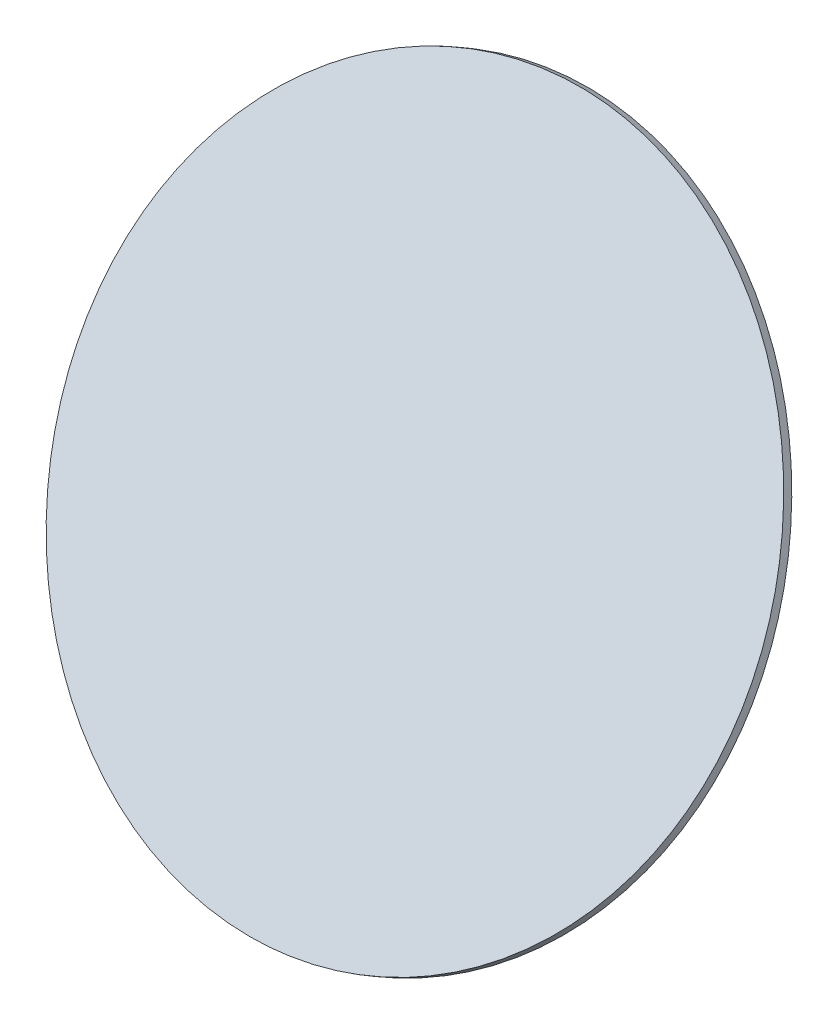
ISO-10303-21;
HEADER;
FILE_DESCRIPTION(('STEP AP214'),'2;1');
FILE_NAME('part.step','',(''),(''),'','','');
FILE_SCHEMA(('AUTOMOTIVE_DESIGN { 1 0 10303 214 1 1 1 1 }'));
ENDSEC;
DATA;
#1=APPLICATION_CONTEXT('core data for automotive mechanical design processes');
#2=APPLICATION_PROTOCOL_DEFINITION('international standard','automotive_design',2000,#1);
#3=PRODUCT_CONTEXT('',#1,'mechanical');
#4=PRODUCT('Part','Part','',(#3));
#5=PRODUCT_RELATED_PRODUCT_CATEGORY('part','',(#4));
#6=PRODUCT_DEFINITION_FORMATION('','',#4);
#7=PRODUCT_DEFINITION_CONTEXT('part definition',#1,'design');
#8=PRODUCT_DEFINITION('design','',#6,#7);
#9=PRODUCT_DEFINITION_SHAPE('','',#8);
#10=(LENGTH_UNIT() NAMED_UNIT(*) SI_UNIT(.MILLI.,.METRE.));
#11=(NAMED_UNIT(*) PLANE_ANGLE_UNIT() SI_UNIT($,.RADIAN.));
#12=(NAMED_UNIT(*) SI_UNIT($,.STERADIAN.) SOLID_ANGLE_UNIT());
#13=UNCERTAINTY_MEASURE_WITH_UNIT(LENGTH_MEASURE(1.E-05),#10,'distance_accuracy_value','');
#14=(GEOMETRIC_REPRESENTATION_CONTEXT(3) GLOBAL_UNCERTAINTY_ASSIGNED_CONTEXT((#13)) GLOBAL_UNIT_ASSIGNED_CONTEXT((#10,
#11,#12)) REPRESENTATION_CONTEXT('',''));
#15=CARTESIAN_POINT('',(0.,0.,0.));
#16=DIRECTION('',(0.,0.,1.));
#17=DIRECTION('',(1.,0.,0.));
#18=AXIS2_PLACEMENT_3D('',#15,#16,#17);
#19=CARTESIAN_POINT('',(0.,-10.7951541416687,54.9949368419566));
#20=CARTESIAN_POINT('',(-0.9253817358664,-10.7951541416687,54.9949368419566));
#21=CARTESIAN_POINT('',(-2.77614520759921,-10.6372913144209,54.90379469615));
#22=CARTESIAN_POINT('',(-5.44560471175056,-9.93600846168661,54.4989088523458));
#23=CARTESIAN_POINT('',(-7.90579268075964,-8.79718690383643,53.8414099193621));
#24=CARTESIAN_POINT('',(-10.0621654706667,-7.26459091468002,52.9565652124637));
#25=CARTESIAN_POINT('',(-11.8318548844635,-5.39711729859095,51.8783788175101));
#26=CARTESIAN_POINT('',(-13.146852750431,-3.26653201934424,50.6482848330056));
#27=CARTESIAN_POINT('',(-13.9566244380395,-0.954712274375363,49.3135550809299));
#28=CARTESIAN_POINT('',(-14.2300508754592,1.44949999999999,47.9254824771303));
#29=CARTESIAN_POINT('',(-13.9566244380395,3.85371227437533,46.5374098733306));
#30=CARTESIAN_POINT('',(-13.146852750431,6.16553201934421,45.202680121255));
#31=CARTESIAN_POINT('',(-11.8318548844635,8.29611729859091,43.9725861367505));
#32=CARTESIAN_POINT('',(-10.0621654706667,10.16359091468,42.8943997417969));
#33=CARTESIAN_POINT('',(-7.90579268075964,11.6961869038364,42.0095550348985));
#34=CARTESIAN_POINT('',(-5.44560471175057,12.8350084616866,41.3520561019148));
#35=CARTESIAN_POINT('',(-2.77614520759922,13.5362913144209,40.9471702581105));
#36=CARTESIAN_POINT('',(0.,13.7730855552926,40.8104570394007));
#37=CARTESIAN_POINT('',(2.77614520759922,13.5362913144209,40.9471702581105));
#38=CARTESIAN_POINT('',(5.44560471175056,12.8350084616866,41.3520561019148));
#39=CARTESIAN_POINT('',(7.90579268075966,11.6961869038364,42.0095550348985));
#40=CARTESIAN_POINT('',(10.0621654706667,10.16359091468,42.8943997417969));
#41=CARTESIAN_POINT('',(11.8318548844635,8.29611729859091,43.9725861367505));
#42=CARTESIAN_POINT('',(13.146852750431,6.16553201934422,45.202680121255));
#43=CARTESIAN_POINT('',(13.9566244380395,3.85371227437534,46.5374098733307));
#44=CARTESIAN_POINT('',(14.2300508754592,1.44949999999998,47.9254824771303));
#45=CARTESIAN_POINT('',(13.9566244380395,-0.954712274375353,49.3135550809299));
#46=CARTESIAN_POINT('',(13.146852750431,-3.26653201934424,50.6482848330056));
#47=CARTESIAN_POINT('',(11.8318548844635,-5.39711729859094,51.8783788175101));
#48=CARTESIAN_POINT('',(10.0621654706668,-7.26459091468002,52.9565652124637));
#49=CARTESIAN_POINT('',(7.90579268075966,-8.79718690383643,53.8414099193621));
#50=CARTESIAN_POINT('',(5.44560471175058,-9.93600846168662,54.4989088523458));
#51=CARTESIAN_POINT('',(2.77614520759922,-10.6372913144209,54.90379469615));
#52=CARTESIAN_POINT('',(0.925381735866414,-10.7951541416687,54.9949368419566));
#53=CARTESIAN_POINT('',(0.,-10.7951541416687,54.9949368419566));
#54=B_SPLINE_CURVE_WITH_KNOTS('',3,(#19,#20,#21,#22,#23,#24,#25,#26,#27,#28,#29,#30,#31,#32,#33,
#34,#35,#36,#37,#38,#39,#40,#41,#42,#43,#44,#45,#46,#47,#48,#49,#50,#51,#52,#53),.UNSPECIFIED.,
.T.,.F.,(4,1,1,1,1,1,1,1,1,1,1,1,1,1,1,1,1,1,1,1,1,1,1,1,1,1,1,1,1,1,1,1,4),(0.,0.03125,0.0625,
0.09375,0.125,0.15625,0.1875,0.21875,0.25,0.28125,0.3125,0.34375,0.375,0.40625,0.4375,0.46875,
0.5,0.53125,0.5625,0.59375,0.625,0.65625,0.6875,0.71875,0.75,0.78125,0.8125,0.84375,0.875,
0.90625,0.9375,0.96875,1.),.UNSPECIFIED.);
#55=DIRECTION('',(0.,0.5,0.866025403784438));
#56=VECTOR('',#55,1.);
#57=SURFACE_OF_LINEAR_EXTRUSION('',#54,#56);
#58=CARTESIAN_POINT('',(0.,-10.7951541416687,54.9949368419566));
#59=CARTESIAN_POINT('',(0.231346854511271,-10.7951541001114,54.9949368179634));
#60=CARTESIAN_POINT('',(0.462692025309563,-10.7902208694024,54.9920886158857));
#61=CARTESIAN_POINT('',(0.924826718682877,-10.7705354525249,54.9807232351523));
#62=CARTESIAN_POINT('',(1.15561623692773,-10.7557831900842,54.972206012461));
#63=CARTESIAN_POINT('',(1.61608373302784,-10.7165071340625,54.9495299709442));
#64=CARTESIAN_POINT('',(1.84576171088309,-10.6919833404815,54.9353711521187));
#65=CARTESIAN_POINT('',(2.30345164583323,-10.6332113193435,54.9014391098938));
#66=CARTESIAN_POINT('',(2.53146361585561,-10.5989631673257,54.8816659301071));
#67=CARTESIAN_POINT('',(2.98526489819354,-10.5207899242286,54.8365325871615));
#68=CARTESIAN_POINT('',(3.2110542105091,-10.4768648331495,54.8111724240028));
#69=CARTESIAN_POINT('',(3.65987506699375,-10.3794784326177,54.7549463594404));
#70=CARTESIAN_POINT('',(3.88290658972718,-10.3260170490915,54.7240804152703));
#71=CARTESIAN_POINT('',(4.32567844468135,-10.2096982554753,54.6569237284641));
#72=CARTESIAN_POINT('',(4.5454187769021,-10.1468408453853,54.6206329858281));
#73=CARTESIAN_POINT('',(4.98107473813176,-10.0118699366455,54.5427074953344));
#74=CARTESIAN_POINT('',(5.19699039683707,-9.93975650989916,54.5010727889903));
#75=CARTESIAN_POINT('',(5.62446184828332,-9.78641417843543,54.4125405526415));
#76=CARTESIAN_POINT('',(5.83601764102427,-9.705185273718,54.3656430226369));
#77=CARTESIAN_POINT('',(6.25427621111408,-9.53384041633558,54.2667170231029));
#78=CARTESIAN_POINT('',(6.4609789507525,-9.44372439464188,54.2146885137198));
#79=CARTESIAN_POINT('',(6.86903982866422,-9.25483292353023,54.1056319720258));
#80=CARTESIAN_POINT('',(7.07039796693752,-9.15605747411228,54.0486039397151));
#81=CARTESIAN_POINT('',(7.46727790315038,-8.95007453568383,53.9296796347649));
#82=CARTESIAN_POINT('',(7.66279974641348,-8.84286711217793,53.8677833999447));
#83=CARTESIAN_POINT('',(8.04751388873849,-8.62024855172618,53.7392545141412));
#84=CARTESIAN_POINT('',(8.23670618780041,-8.50483741478033,53.6726218631581));
#85=CARTESIAN_POINT('',(8.60832902655066,-8.26611878743877,53.5347975994018));
#86=CARTESIAN_POINT('',(8.79075951370299,-8.14281123571205,53.4636059512193));
#87=CARTESIAN_POINT('',(9.14842786458957,-7.88860608037778,53.3168405363577));
#88=CARTESIAN_POINT('',(9.32366572832382,-7.75770847677023,53.2412667696786));
#89=CARTESIAN_POINT('',(9.6665177659532,-7.48862931746853,53.0859138446224));
#90=CARTESIAN_POINT('',(9.83413199905726,-7.35044781836277,53.0061347189167));
#91=CARTESIAN_POINT('',(10.1613044835728,-7.06710813535304,52.8425484766589));
#92=CARTESIAN_POINT('',(10.3208627349843,-6.92194995144908,52.7587413601069));
#93=CARTESIAN_POINT('',(10.6315685850966,-6.62503137712277,52.5873153412922));
#94=CARTESIAN_POINT('',(10.7827161184548,-6.47327093542399,52.4996964094251));
#95=CARTESIAN_POINT('',(11.076246948178,-6.16352105742654,52.3208622339818));
#96=CARTESIAN_POINT('',(11.2186302445431,-6.00553162112788,52.2296469904056));
#97=CARTESIAN_POINT('',(11.4942787720556,-5.68369680214361,52.0438355710305));
#98=CARTESIAN_POINT('',(11.6275440740219,-5.51985146495553,51.9492394214995));
#99=CARTESIAN_POINT('',(11.8846018456287,-5.18667924450715,51.7568823503371));
#100=CARTESIAN_POINT('',(12.0083943152692,-5.01735236124687,51.6591214287057));
#101=CARTESIAN_POINT('',(12.2462429251696,-4.67364425423332,51.4606814605988));
#102=CARTESIAN_POINT('',(12.3602989897912,-4.49926299122872,51.3600023914615));
#103=CARTESIAN_POINT('',(12.5784120731789,-4.1458719046698,51.1559719525075));
#104=CARTESIAN_POINT('',(12.6824690919449,-3.96686208111548,51.0526205826908));
#105=CARTESIAN_POINT('',(12.8803210910136,-3.60463953405516,50.843491297639));
#106=CARTESIAN_POINT('',(12.9741161510237,-3.42142684320737,50.737713401259));
#107=CARTESIAN_POINT('',(13.1511806237187,-3.05122570690705,50.5239776755617));
#108=CARTESIAN_POINT('',(13.2344500364035,-2.86423726145452,50.4160198462444));
#109=CARTESIAN_POINT('',(13.3903010174004,-2.48694813155253,50.1981918655331));
#110=CARTESIAN_POINT('',(13.4628825026855,-2.29664742138525,50.0883216992911));
#111=CARTESIAN_POINT('',(13.5971958762622,-1.91319574753732,49.8669357721738));
#112=CARTESIAN_POINT('',(13.6589277645539,-1.72004478385666,49.7554200112985));
#113=CARTESIAN_POINT('',(13.7713798938113,-1.33135451806708,49.5310095817135));
#114=CARTESIAN_POINT('',(13.8221002203099,-1.13581523452199,49.4181149237216));
#115=CARTESIAN_POINT('',(13.9123669057062,-0.742811804426555,49.1912142875635));
#116=CARTESIAN_POINT('',(13.9519132646039,-0.545347657876198,49.0772083093974));
#117=CARTESIAN_POINT('',(14.0197773508999,-0.14897651476172,48.8483633232213));
#118=CARTESIAN_POINT('',(14.048094991073,0.0499304929983838,48.7335243087473));
#119=CARTESIAN_POINT('',(14.0934470672161,0.448706921351527,48.5032906304911));
#120=CARTESIAN_POINT('',(14.110481503186,0.648576341944566,48.3878959667089));
#121=CARTESIAN_POINT('',(14.1332122903687,1.04879717752914,48.1568283595489));
#122=CARTESIAN_POINT('',(14.1389087296526,1.24914858876457,48.0411554183396));
#123=CARTESIAN_POINT('',(14.1389087296526,1.64985141123542,47.809809535921));
#124=CARTESIAN_POINT('',(14.1332122903687,1.85020282247084,47.6941365947117));
#125=CARTESIAN_POINT('',(14.110481503186,2.25042365805542,47.4630689875517));
#126=CARTESIAN_POINT('',(14.0934470672161,2.45029307864846,47.3476743237695));
#127=CARTESIAN_POINT('',(14.048094991073,2.8490695070016,47.1174406455133));
#128=CARTESIAN_POINT('',(14.0197773508999,3.04797651476171,47.0026016310393));
#129=CARTESIAN_POINT('',(13.9519132646039,3.44434765787619,46.7737566448632));
#130=CARTESIAN_POINT('',(13.9123669057062,3.64181180442654,46.659750666697));
#131=CARTESIAN_POINT('',(13.8221002203099,4.03481523452198,46.432850030539));
#132=CARTESIAN_POINT('',(13.7713798938113,4.23035451806706,46.3199553725471));
#133=CARTESIAN_POINT('',(13.6589277645539,4.61904478385665,46.0955449429621));
#134=CARTESIAN_POINT('',(13.5971958762622,4.8121957475373,45.9840291820868));
#135=CARTESIAN_POINT('',(13.4628825026855,5.19564742138523,45.7626432549695));
#136=CARTESIAN_POINT('',(13.3903010174004,5.38594813155251,45.6527730887274));
#137=CARTESIAN_POINT('',(13.2344500364035,5.7632372614545,45.4349451080162));
#138=CARTESIAN_POINT('',(13.1511806237187,5.95022570690703,45.3269872786988));
#139=CARTESIAN_POINT('',(12.9741161510237,6.32042684320735,45.1132515530015));
#140=CARTESIAN_POINT('',(12.8803210910136,6.50363953405515,45.0074736566216));
#141=CARTESIAN_POINT('',(12.6824690919449,6.86586208111546,44.7983443715698));
#142=CARTESIAN_POINT('',(12.5784120731789,7.04487190466979,44.6949930017531));
#143=CARTESIAN_POINT('',(12.3602989897912,7.3982629912287,44.4909625627991));
#144=CARTESIAN_POINT('',(12.2462429251696,7.5726442542333,44.3902834936618));
#145=CARTESIAN_POINT('',(12.0083943152692,7.91635236124684,44.1918435255548));
#146=CARTESIAN_POINT('',(11.8846018456287,8.08567924450713,44.0940826039235));
#147=CARTESIAN_POINT('',(11.6275440740219,8.41885146495551,43.9017255327611));
#148=CARTESIAN_POINT('',(11.4942787720556,8.58269680214359,43.8071293832301));
#149=CARTESIAN_POINT('',(11.2186302445431,8.90453162112786,43.6213179638549));
#150=CARTESIAN_POINT('',(11.076246948178,9.06252105742653,43.5301027202788));
#151=CARTESIAN_POINT('',(10.7827161184548,9.37227093542398,43.3512685448355));
#152=CARTESIAN_POINT('',(10.6315685850966,9.52403137712276,43.2636496129684));
#153=CARTESIAN_POINT('',(10.3208627349843,9.82094995144907,43.0922235941537));
#154=CARTESIAN_POINT('',(10.1613044835728,9.96610813535303,43.0084164776017));
#155=CARTESIAN_POINT('',(9.83413199905726,10.2494478183628,42.8448302353439));
#156=CARTESIAN_POINT('',(9.6665177659532,10.3876293174685,42.7650511096381));
#157=CARTESIAN_POINT('',(9.32366572832381,10.6567084767702,42.609698184582));
#158=CARTESIAN_POINT('',(9.14842786458955,10.7876060803778,42.5341244179029));
#159=CARTESIAN_POINT('',(8.79075951370299,11.041811235712,42.3873590030413));
#160=CARTESIAN_POINT('',(8.60832902655069,11.1651187874388,42.3161673548587));
#161=CARTESIAN_POINT('',(8.23670618780037,11.4038374147803,42.1783430911025));
#162=CARTESIAN_POINT('',(8.04751388873836,11.5192485517262,42.1117104401193));
#163=CARTESIAN_POINT('',(7.66279974641361,11.7418671121779,41.9831815543159));
#164=CARTESIAN_POINT('',(7.46727790315088,11.8490745356838,41.9212853194957));
#165=CARTESIAN_POINT('',(7.07039796693702,12.0550574741123,41.8023610145455));
#166=CARTESIAN_POINT('',(6.86903982866235,12.1538329235303,41.7453329822347));
#167=CARTESIAN_POINT('',(6.46097895075434,12.3427243946418,41.6362764405408));
#168=CARTESIAN_POINT('',(6.25427621112099,12.4328404163353,41.5842479311578));
#169=CARTESIAN_POINT('',(5.83601764101734,12.6041852737183,41.4853219316235));
#170=CARTESIAN_POINT('',(5.62446184825748,12.6854141784365,41.4384244016184));
#171=CARTESIAN_POINT('',(5.19699039686289,12.838756509898,41.3498921652709));
#172=CARTESIAN_POINT('',(4.98107473822815,12.9108699366413,41.3082574589285));
#173=CARTESIAN_POINT('',(4.54541877680569,13.0458408453894,41.2303319684301));
#174=CARTESIAN_POINT('',(4.32567844432157,13.1086982554906,41.1940412257875));
#175=CARTESIAN_POINT('',(3.88290659008694,13.2250170490761,41.1268845389992));
#176=CARTESIAN_POINT('',(3.65987506833642,13.2784784325603,41.0960185948533));
#177=CARTESIAN_POINT('',(3.21105420916641,13.3758648332068,41.0397925302246));
#178=CARTESIAN_POINT('',(2.98526489318262,13.4197899244428,41.0144323669753));
#179=CARTESIAN_POINT('',(2.53146362086652,13.4979631671114,40.9692990242772));
#180=CARTESIAN_POINT('',(2.30345166453423,13.5322113185441,40.9495258448283));
#181=CARTESIAN_POINT('',(1.84576169218194,13.590983341281,40.9155938016803));
#182=CARTESIAN_POINT('',(1.61608366323394,13.6155071370462,40.9014349815938));
#183=CARTESIAN_POINT('',(1.15561630672161,13.6547831871004,40.8787589435222));
#184=CARTESIAN_POINT('',(0.924826979157281,13.6695354413895,40.8702417255373));
#185=CARTESIAN_POINT('',(0.462691764837179,13.6892208805377,40.858876331946));
#186=CARTESIAN_POINT('',(0.231345882418591,13.6941541416687,40.856028112304));
#187=CARTESIAN_POINT('',(-0.231345882418585,13.6941541416687,40.856028112304));
#188=CARTESIAN_POINT('',(-0.462691764837173,13.6892208805377,40.858876331946));
#189=CARTESIAN_POINT('',(-0.924826979157276,13.6695354413895,40.8702417255373));
#190=CARTESIAN_POINT('',(-1.15561630672161,13.6547831871004,40.8787589435222));
#191=CARTESIAN_POINT('',(-1.61608366323394,13.6155071370462,40.9014349815938));
#192=CARTESIAN_POINT('',(-1.84576169218194,13.590983341281,40.9155938016803));
#193=CARTESIAN_POINT('',(-2.30345166453423,13.5322113185441,40.9495258448283));
#194=CARTESIAN_POINT('',(-2.53146362086652,13.4979631671114,40.9692990242772));
#195=CARTESIAN_POINT('',(-2.98526489318262,13.4197899244428,41.0144323669753));
#196=CARTESIAN_POINT('',(-3.21105420916642,13.3758648332068,41.0397925302246));
#197=CARTESIAN_POINT('',(-3.65987506833643,13.2784784325603,41.0960185948533));
#198=CARTESIAN_POINT('',(-3.88290659008695,13.2250170490761,41.1268845389992));
#199=CARTESIAN_POINT('',(-4.32567844432158,13.1086982554906,41.1940412257876));
#200=CARTESIAN_POINT('',(-4.54541877680569,13.0458408453894,41.2303319684301));
#201=CARTESIAN_POINT('',(-4.98107473822816,12.9108699366413,41.3082574589285));
#202=CARTESIAN_POINT('',(-5.19699039686289,12.838756509898,41.349892165271));
#203=CARTESIAN_POINT('',(-5.62446184825749,12.6854141784365,41.4384244016184));
#204=CARTESIAN_POINT('',(-5.83601764101734,12.6041852737183,41.4853219316235));
#205=CARTESIAN_POINT('',(-6.254276211121,12.4328404163353,41.5842479311578));
#206=CARTESIAN_POINT('',(-6.46097895075435,12.3427243946418,41.6362764405409));
#207=CARTESIAN_POINT('',(-6.86903982866236,12.1538329235303,41.7453329822347));
#208=CARTESIAN_POINT('',(-7.07039796693702,12.0550574741123,41.8023610145455));
#209=CARTESIAN_POINT('',(-7.46727790315087,11.8490745356838,41.9212853194957));
#210=CARTESIAN_POINT('',(-7.66279974641361,11.7418671121779,41.9831815543159));
#211=CARTESIAN_POINT('',(-8.04751388873835,11.5192485517262,42.1117104401193));
#212=CARTESIAN_POINT('',(-8.23670618780037,11.4038374147803,42.1783430911025));
#213=CARTESIAN_POINT('',(-8.60832902655069,11.1651187874388,42.3161673548587));
#214=CARTESIAN_POINT('',(-8.79075951370299,11.041811235712,42.3873590030413));
#215=CARTESIAN_POINT('',(-9.14842786458955,10.7876060803778,42.5341244179029));
#216=CARTESIAN_POINT('',(-9.32366572832381,10.6567084767702,42.609698184582));
#217=CARTESIAN_POINT('',(-9.66651776595319,10.3876293174685,42.7650511096381));
#218=CARTESIAN_POINT('',(-9.83413199905725,10.2494478183627,42.8448302353439));
#219=CARTESIAN_POINT('',(-10.1613044835728,9.96610813535302,43.0084164776017));
#220=CARTESIAN_POINT('',(-10.3208627349843,9.82094995144906,43.0922235941537));
#221=CARTESIAN_POINT('',(-10.6315685850966,9.52403137712275,43.2636496129684));
#222=CARTESIAN_POINT('',(-10.7827161184548,9.37227093542396,43.3512685448355));
#223=CARTESIAN_POINT('',(-11.076246948178,9.06252105742651,43.5301027202788));
#224=CARTESIAN_POINT('',(-11.2186302445431,8.90453162112785,43.6213179638549));
#225=CARTESIAN_POINT('',(-11.4942787720556,8.58269680214359,43.8071293832301));
#226=CARTESIAN_POINT('',(-11.6275440740219,8.4188514649555,43.9017255327611));
#227=CARTESIAN_POINT('',(-11.8846018456287,8.08567924450712,44.0940826039235));
#228=CARTESIAN_POINT('',(-12.0083943152692,7.91635236124684,44.1918435255549));
#229=CARTESIAN_POINT('',(-12.2462429251696,7.57264425423329,44.3902834936618));
#230=CARTESIAN_POINT('',(-12.3602989897912,7.39826299122869,44.4909625627991));
#231=CARTESIAN_POINT('',(-12.5784120731789,7.04487190466977,44.6949930017531));
#232=CARTESIAN_POINT('',(-12.6824690919449,6.86586208111545,44.7983443715698));
#233=CARTESIAN_POINT('',(-12.8803210910136,6.50363953405514,45.0074736566216));
#234=CARTESIAN_POINT('',(-12.9741161510237,6.32042684320734,45.1132515530016));
#235=CARTESIAN_POINT('',(-13.1511806237187,5.95022570690702,45.3269872786988));
#236=CARTESIAN_POINT('',(-13.2344500364035,5.76323726145449,45.4349451080162));
#237=CARTESIAN_POINT('',(-13.3903010174004,5.3859481315525,45.6527730887274));
#238=CARTESIAN_POINT('',(-13.4628825026855,5.19564742138522,45.7626432549695));
#239=CARTESIAN_POINT('',(-13.5971958762622,4.81219574753729,45.9840291820868));
#240=CARTESIAN_POINT('',(-13.6589277645539,4.61904478385664,46.0955449429621));
#241=CARTESIAN_POINT('',(-13.7713798938113,4.23035451806705,46.3199553725471));
#242=CARTESIAN_POINT('',(-13.8221002203099,4.03481523452197,46.432850030539));
#243=CARTESIAN_POINT('',(-13.9123669057062,3.64181180442653,46.659750666697));
#244=CARTESIAN_POINT('',(-13.9519132646039,3.44434765787617,46.7737566448632));
#245=CARTESIAN_POINT('',(-14.0197773508999,3.0479765147617,47.0026016310393));
#246=CARTESIAN_POINT('',(-14.048094991073,2.84906950700159,47.1174406455133));
#247=CARTESIAN_POINT('',(-14.0934470672161,2.45029307864845,47.3476743237695));
#248=CARTESIAN_POINT('',(-14.110481503186,2.25042365805541,47.4630689875517));
#249=CARTESIAN_POINT('',(-14.1332122903687,1.85020282247083,47.6941365947117));
#250=CARTESIAN_POINT('',(-14.1389087296526,1.64985141123541,47.809809535921));
#251=CARTESIAN_POINT('',(-14.1389087296526,1.24914858876456,48.0411554183396));
#252=CARTESIAN_POINT('',(-14.1332122903687,1.04879717752914,48.1568283595489));
#253=CARTESIAN_POINT('',(-14.110481503186,0.648576341944559,48.3878959667089));
#254=CARTESIAN_POINT('',(-14.0934470672161,0.448706921351517,48.5032906304911));
#255=CARTESIAN_POINT('',(-14.048094991073,0.0499304929983737,48.7335243087473));
#256=CARTESIAN_POINT('',(-14.0197773508999,-0.148976514761728,48.8483633232213));
#257=CARTESIAN_POINT('',(-13.9519132646039,-0.545347657876207,49.0772083093974));
#258=CARTESIAN_POINT('',(-13.9123669057062,-0.742811804426567,49.1912142875636));
#259=CARTESIAN_POINT('',(-13.8221002203099,-1.13581523452201,49.4181149237216));
#260=CARTESIAN_POINT('',(-13.7713798938113,-1.33135451806708,49.5310095817135));
#261=CARTESIAN_POINT('',(-13.6589277645539,-1.72004478385667,49.7554200112985));
#262=CARTESIAN_POINT('',(-13.5971958762622,-1.91319574753732,49.8669357721738));
#263=CARTESIAN_POINT('',(-13.4628825026855,-2.29664742138525,50.0883216992911));
#264=CARTESIAN_POINT('',(-13.3903010174004,-2.48694813155253,50.1981918655331));
#265=CARTESIAN_POINT('',(-13.2344500364035,-2.86423726145452,50.4160198462444));
#266=CARTESIAN_POINT('',(-13.1511806237187,-3.05122570690705,50.5239776755617));
#267=CARTESIAN_POINT('',(-12.9741161510237,-3.42142684320737,50.737713401259));
#268=CARTESIAN_POINT('',(-12.8803210910136,-3.60463953405517,50.843491297639));
#269=CARTESIAN_POINT('',(-12.6824690919449,-3.96686208111549,51.0526205826908));
#270=CARTESIAN_POINT('',(-12.5784120731789,-4.14587190466981,51.1559719525075));
#271=CARTESIAN_POINT('',(-12.3602989897912,-4.49926299122872,51.3600023914615));
#272=CARTESIAN_POINT('',(-12.2462429251696,-4.67364425423332,51.4606814605988));
#273=CARTESIAN_POINT('',(-12.0083943152692,-5.01735236124687,51.6591214287057));
#274=CARTESIAN_POINT('',(-11.8846018456287,-5.18667924450716,51.7568823503371));
#275=CARTESIAN_POINT('',(-11.6275440740219,-5.51985146495553,51.9492394214995));
#276=CARTESIAN_POINT('',(-11.4942787720556,-5.68369680214361,52.0438355710305));
#277=CARTESIAN_POINT('',(-11.2186302445431,-6.00553162112788,52.2296469904056));
#278=CARTESIAN_POINT('',(-11.076246948178,-6.16352105742655,52.3208622339818));
#279=CARTESIAN_POINT('',(-10.7827161184548,-6.47327093542399,52.4996964094251));
#280=CARTESIAN_POINT('',(-10.6315685850966,-6.62503137712278,52.5873153412922));
#281=CARTESIAN_POINT('',(-10.3208627349843,-6.92194995144908,52.7587413601069));
#282=CARTESIAN_POINT('',(-10.1613044835728,-7.06710813535305,52.8425484766589));
#283=CARTESIAN_POINT('',(-9.83413199905725,-7.35044781836277,53.0061347189167));
#284=CARTESIAN_POINT('',(-9.66651776595319,-7.48862931746854,53.0859138446224));
#285=CARTESIAN_POINT('',(-9.32366572832381,-7.75770847677023,53.2412667696786));
#286=CARTESIAN_POINT('',(-9.14842786458956,-7.88860608037778,53.3168405363577));
#287=CARTESIAN_POINT('',(-8.79075951370298,-8.14281123571205,53.4636059512193));
#288=CARTESIAN_POINT('',(-8.60832902655065,-8.26611878743877,53.5347975994018));
#289=CARTESIAN_POINT('',(-8.2367061878004,-8.50483741478033,53.6726218631581));
#290=CARTESIAN_POINT('',(-8.04751388873848,-8.62024855172618,53.7392545141412));
#291=CARTESIAN_POINT('',(-7.66279974641347,-8.84286711217793,53.8677833999447));
#292=CARTESIAN_POINT('',(-7.46727790315037,-8.95007453568383,53.9296796347649));
#293=CARTESIAN_POINT('',(-7.07039796693751,-9.15605747411228,54.0486039397151));
#294=CARTESIAN_POINT('',(-6.86903982866421,-9.25483292353023,54.1056319720258));
#295=CARTESIAN_POINT('',(-6.46097895075249,-9.44372439464188,54.2146885137198));
#296=CARTESIAN_POINT('',(-6.25427621111407,-9.53384041633558,54.2667170231029));
#297=CARTESIAN_POINT('',(-5.83601764102426,-9.705185273718,54.3656430226369));
#298=CARTESIAN_POINT('',(-5.62446184828331,-9.78641417843543,54.4125405526415));
#299=CARTESIAN_POINT('',(-5.19699039683705,-9.93975650989916,54.5010727889902));
#300=CARTESIAN_POINT('',(-4.98107473813175,-10.0118699366455,54.5427074953344));
#301=CARTESIAN_POINT('',(-4.54541877690208,-10.1468408453853,54.6206329858281));
#302=CARTESIAN_POINT('',(-4.32567844468134,-10.2096982554753,54.6569237284641));
#303=CARTESIAN_POINT('',(-3.88290658972717,-10.3260170490915,54.7240804152703));
#304=CARTESIAN_POINT('',(-3.65987506699374,-10.3794784326177,54.7549463594404));
#305=CARTESIAN_POINT('',(-3.21105421050909,-10.4768648331495,54.8111724240028));
#306=CARTESIAN_POINT('',(-2.98526489819354,-10.5207899242286,54.8365325871615));
#307=CARTESIAN_POINT('',(-2.5314636158556,-10.5989631673257,54.881665930107));
#308=CARTESIAN_POINT('',(-2.30345164583322,-10.6332113193436,54.9014391098938));
#309=CARTESIAN_POINT('',(-1.84576171088308,-10.6919833404816,54.9353711521187));
#310=CARTESIAN_POINT('',(-1.61608373302783,-10.7165071340625,54.9495299709442));
#311=CARTESIAN_POINT('',(-1.15561623692772,-10.7557831900842,54.972206012461));
#312=CARTESIAN_POINT('',(-0.924826718682868,-10.7705354525249,54.9807232351523));
#313=CARTESIAN_POINT('',(-0.462692025309553,-10.7902208694024,54.9920886158857));
#314=CARTESIAN_POINT('',(-0.231346854511261,-10.7951541001114,54.9949368179634));
#315=CARTESIAN_POINT('',(0.,-10.7951541416687,54.9949368419566));
#316=B_SPLINE_CURVE_WITH_KNOTS('',3,(#58,#59,#60,#61,#62,#63,#64,#65,#66,#67,#68,#69,#70,#71,
#72,#73,#74,#75,#76,#77,#78,#79,#80,#81,#82,#83,#84,#85,#86,#87,#88,#89,#90,#91,#92,#93,#94,#95,
#96,#97,#98,#99,#100,#101,#102,#103,#104,#105,#106,#107,#108,#109,#110,#111,#112,#113,#114,#115,
#116,#117,#118,#119,#120,#121,#122,#123,#124,#125,#126,#127,#128,#129,#130,#131,#132,#133,#134,
#135,#136,#137,#138,#139,#140,#141,#142,#143,#144,#145,#146,#147,#148,#149,#150,#151,#152,#153,
#154,#155,#156,#157,#158,#159,#160,#161,#162,#163,#164,#165,#166,#167,#168,#169,#170,#171,#172,
#173,#174,#175,#176,#177,#178,#179,#180,#181,#182,#183,#184,#185,#186,#187,#188,#189,#190,#191,
#192,#193,#194,#195,#196,#197,#198,#199,#200,#201,#202,#203,#204,#205,#206,#207,#208,#209,#210,
#211,#212,#213,#214,#215,#216,#217,#218,#219,#220,#221,#222,#223,#224,#225,#226,#227,#228,#229,
#230,#231,#232,#233,#234,#235,#236,#237,#238,#239,#240,#241,#242,#243,#244,#245,#246,#247,#248,
#249,#250,#251,#252,#253,#254,#255,#256,#257,#258,#259,#260,#261,#262,#263,#264,#265,#266,#267,
#268,#269,#270,#271,#272,#273,#274,#275,#276,#277,#278,#279,#280,#281,#282,#283,#284,#285,#286,
#287,#288,#289,#290,#291,#292,#293,#294,#295,#296,#297,#298,#299,#300,#301,#302,#303,#304,#305,
#306,#307,#308,#309,#310,#311,#312,#313,#314,#315),.UNSPECIFIED.,.F.,.F.,(4,2,2,2,2,2,2,2,2,2,2,
2,2,2,2,2,2,2,2,2,2,2,2,2,2,2,2,2,2,2,2,2,2,2,2,2,2,2,2,2,2,2,2,2,2,2,2,2,2,2,2,2,2,2,2,2,2,2,2,
2,2,2,2,2,2,2,2,2,2,2,2,2,2,2,2,2,2,2,2,2,2,2,2,2,2,2,2,2,2,2,2,2,2,2,2,2,2,2,2,2,2,2,2,2,2,2,2,
2,2,2,2,2,2,2,2,2,2,2,2,2,2,2,2,2,2,2,2,2,4),(0.,0.693968245412316,1.38794188149219,
2.08191551757205,2.77588376298437,3.46985200839669,4.16382564447656,4.85779928055643,
5.55176752596875,6.24573577138107,6.93970940746094,7.63368304354081,8.32765128895312,
9.02161953436544,9.71559317044531,10.4095668065252,11.1035350519375,11.7975032973498,
12.4914769334297,13.1854505695096,13.8794188149219,14.5733870603342,15.2673606964141,
15.9613343324939,16.6553025779062,17.3492708233186,18.0432444593984,18.7372180954783,
19.4311863408906,20.125154586303,20.8191282223828,21.5131018584627,22.207070103875,
22.9010383492873,23.5950119853672,24.2889856214471,24.9829538668594,25.6769221122717,
26.3708957483516,27.0648693844315,27.7588376298438,28.4528058752561,29.146779511336,
29.8407531474158,30.5347213928281,31.2286896382405,31.9226632743203,32.6166369104002,
33.3106051558125,34.0045734012248,34.6985470373047,35.3925206733846,36.0864889187969,
36.7804571642092,37.4744308002891,38.1684044363689,38.8623726817813,39.5563409271936,
40.2503145632734,40.9442881993533,41.6382564447656,42.332224690178,43.0261983262578,
43.7201719623377,44.41414020775,45.1081084531623,45.8020820892422,46.4960557253221,
47.1900239707344,47.8839922161467,48.5779658522266,49.2719394883064,49.9659077337188,
50.6598759791311,51.3538496152109,52.0478232512908,52.7417914967031,53.4357597421154,
54.1297333781953,54.8237070142752,55.5176752596875,56.2116435050998,56.9056171411797,
57.5995907772596,58.2935590226719,58.9875272680842,59.6815009041641,60.3754745402439,
61.0694427856563,61.7634110310686,62.4573846671484,63.1513583032283,63.8453265486406,
64.5392947940529,65.2332684301328,65.9272420662127,66.621210311625,67.3151785570373,
68.0091521931172,68.703125829197,69.3970940746094,70.0910623200217,70.7850359561015,
71.4790095921814,72.1729778375937,72.866946083006,73.5609197190859,74.2548933551658,
74.9488616005781,75.6428298459904,76.3368034820703,77.0307771181502,77.7247453635625,
78.4187136089748,79.1126872450547,79.8066608811345,80.5006291265468,81.1945973719592,
81.888571008039,82.5825446441189,83.2765128895312,83.9704811349435,84.6644547710234,
85.3584284071033,86.0523966525156,86.7463648979279,87.4403385340078,88.1343121700877,
88.8282804155),.UNSPECIFIED.);
#317=CARTESIAN_POINT('',(0.,-10.7951541416687,54.9949368419566));
#318=VERTEX_POINT('',#317);
#319=EDGE_CURVE('E10',#318,#318,#316,.F.);
#320=ORIENTED_EDGE('',*,*,#319,.F.);
#321=EDGE_LOOP('',(#320));
#322=FACE_BOUND('',#321,.T.);
#323=CARTESIAN_POINT('',(0.,-10.5951541416687,55.3413470034704));
#324=CARTESIAN_POINT('',(-0.9253817358664,-10.5951541416687,55.3413470034704));
#325=CARTESIAN_POINT('',(-2.77614520759921,-10.4372913144209,55.2502048576638));
#326=CARTESIAN_POINT('',(-5.44560471175056,-9.73600846168661,54.8453190138596));
#327=CARTESIAN_POINT('',(-7.90579268075964,-8.59718690383643,54.1878200808758));
#328=CARTESIAN_POINT('',(-10.0621654706667,-7.06459091468002,53.3029753739774));
#329=CARTESIAN_POINT('',(-11.8318548844635,-5.19711729859095,52.2247889790239));
#330=CARTESIAN_POINT('',(-13.146852750431,-3.06653201934424,50.9946949945193));
#331=CARTESIAN_POINT('',(-13.9566244380395,-0.754712274375361,49.6599652424437));
#332=CARTESIAN_POINT('',(-14.2300508754592,1.64949999999999,48.2718926386441));
#333=CARTESIAN_POINT('',(-13.9566244380395,4.05371227437533,46.8838200348444));
#334=CARTESIAN_POINT('',(-13.146852750431,6.36553201934421,45.5490902827688));
#335=CARTESIAN_POINT('',(-11.8318548844635,8.49611729859091,44.3189962982642));
#336=CARTESIAN_POINT('',(-10.0621654706667,10.36359091468,43.2408099033107));
#337=CARTESIAN_POINT('',(-7.90579268075964,11.8961869038364,42.3559651964123));
#338=CARTESIAN_POINT('',(-5.44560471175057,13.0350084616866,41.6984662634285));
#339=CARTESIAN_POINT('',(-2.77614520759922,13.7362913144209,41.2935804196243));
#340=CARTESIAN_POINT('',(0.,13.9730855552926,41.1568672009145));
#341=CARTESIAN_POINT('',(2.77614520759922,13.7362913144209,41.2935804196243));
#342=CARTESIAN_POINT('',(5.44560471175056,13.0350084616866,41.6984662634285));
#343=CARTESIAN_POINT('',(7.90579268075966,11.8961869038364,42.3559651964123));
#344=CARTESIAN_POINT('',(10.0621654706667,10.36359091468,43.2408099033107));
#345=CARTESIAN_POINT('',(11.8318548844635,8.49611729859091,44.3189962982642));
#346=CARTESIAN_POINT('',(13.146852750431,6.36553201934422,45.5490902827688));
#347=CARTESIAN_POINT('',(13.9566244380395,4.05371227437534,46.8838200348444));
#348=CARTESIAN_POINT('',(14.2300508754592,1.64949999999998,48.2718926386441));
#349=CARTESIAN_POINT('',(13.9566244380395,-0.754712274375351,49.6599652424437));
#350=CARTESIAN_POINT('',(13.146852750431,-3.06653201934424,50.9946949945194));
#351=CARTESIAN_POINT('',(11.8318548844635,-5.19711729859094,52.2247889790239));
#352=CARTESIAN_POINT('',(10.0621654706668,-7.06459091468002,53.3029753739774));
#353=CARTESIAN_POINT('',(7.90579268075966,-8.59718690383642,54.1878200808758));
#354=CARTESIAN_POINT('',(5.44560471175058,-9.73600846168661,54.8453190138596));
#355=CARTESIAN_POINT('',(2.77614520759922,-10.4372913144209,55.2502048576638));
#356=CARTESIAN_POINT('',(0.925381735866414,-10.5951541416687,55.3413470034704));
#357=CARTESIAN_POINT('',(0.,-10.5951541416687,55.3413470034704));
#358=B_SPLINE_CURVE_WITH_KNOTS('',3,(#323,#324,#325,#326,#327,#328,#329,#330,#331,#332,#333,
#334,#335,#336,#337,#338,#339,#340,#341,#342,#343,#344,#345,#346,#347,#348,#349,#350,#351,#352,
#353,#354,#355,#356,#357),.UNSPECIFIED.,.T.,.F.,(4,1,1,1,1,1,1,1,1,1,1,1,1,1,1,1,1,1,1,1,1,1,1,
1,1,1,1,1,1,1,1,1,4),(0.,0.03125,0.0625,0.09375,0.125,0.15625,0.1875,0.21875,0.25,0.28125,
0.3125,0.34375,0.375,0.40625,0.4375,0.46875,0.5,0.53125,0.5625,0.59375,0.625,0.65625,0.6875,
0.71875,0.75,0.78125,0.8125,0.84375,0.875,0.90625,0.9375,0.96875,1.),.UNSPECIFIED.);
#359=CARTESIAN_POINT('',(0.,-10.5951541416687,55.3413470034704));
#360=VERTEX_POINT('',#359);
#361=EDGE_CURVE('E25',#360,#360,#358,.T.);
#362=ORIENTED_EDGE('',*,*,#361,.T.);
#363=EDGE_LOOP('',(#362));
#364=FACE_BOUND('',#363,.T.);
#365=ADVANCED_FACE('F15',(#322,#364),#57,.F.);
#366=CARTESIAN_POINT('',(0.,-10.458349302036,54.8004824771303));
#367=DIRECTION('',(0.,0.5,0.866025403784438));
#368=DIRECTION('',(-1.,0.,0.));
#369=AXIS2_PLACEMENT_3D('',#366,#367,#368);
#370=PLANE('',#369);
#371=ORIENTED_EDGE('',*,*,#319,.T.);
#372=EDGE_LOOP('',(#371));
#373=FACE_BOUND('',#372,.T.);
#374=ADVANCED_FACE('F60',(#373),#370,.F.);
#375=CARTESIAN_POINT('',(0.,-10.258349302036,55.1468926386441));
#376=DIRECTION('',(0.,0.5,0.866025403784438));
#377=DIRECTION('',(-1.,0.,0.));
#378=AXIS2_PLACEMENT_3D('',#375,#376,#377);
#379=PLANE('',#378);
#380=ORIENTED_EDGE('',*,*,#361,.F.);
#381=EDGE_LOOP('',(#380));
#382=FACE_BOUND('',#381,.T.);
#383=ADVANCED_FACE('F68',(#382),#379,.T.);
#384=CLOSED_SHELL('',(#365,#374,#383));
#385=MANIFOLD_SOLID_BREP('B1',#384);
#386=ADVANCED_BREP_SHAPE_REPRESENTATION('',(#18,#385),#14);
#387=SHAPE_DEFINITION_REPRESENTATION(#9,#386);
ENDSEC;
END-ISO-10303-21;
